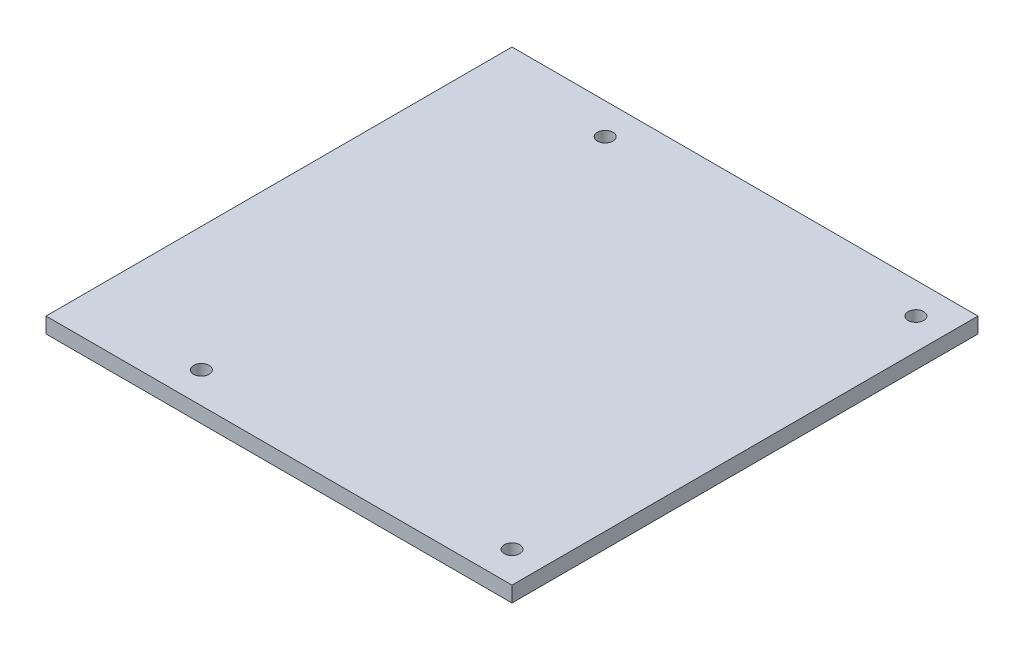
ISO-10303-21;
HEADER;
FILE_DESCRIPTION(('STEP AP214'),'2;1');
FILE_NAME('part.step','',(''),(''),'','','');
FILE_SCHEMA(('AUTOMOTIVE_DESIGN { 1 0 10303 214 1 1 1 1 }'));
ENDSEC;
DATA;
#1=APPLICATION_CONTEXT('core data for automotive mechanical design processes');
#2=APPLICATION_PROTOCOL_DEFINITION('international standard','automotive_design',2000,#1);
#3=PRODUCT_CONTEXT('',#1,'mechanical');
#4=PRODUCT('Part','Part','',(#3));
#5=PRODUCT_RELATED_PRODUCT_CATEGORY('part','',(#4));
#6=PRODUCT_DEFINITION_FORMATION('','',#4);
#7=PRODUCT_DEFINITION_CONTEXT('part definition',#1,'design');
#8=PRODUCT_DEFINITION('design','',#6,#7);
#9=PRODUCT_DEFINITION_SHAPE('','',#8);
#10=(LENGTH_UNIT() NAMED_UNIT(*) SI_UNIT(.MILLI.,.METRE.));
#11=(NAMED_UNIT(*) PLANE_ANGLE_UNIT() SI_UNIT($,.RADIAN.));
#12=(NAMED_UNIT(*) SI_UNIT($,.STERADIAN.) SOLID_ANGLE_UNIT());
#13=UNCERTAINTY_MEASURE_WITH_UNIT(LENGTH_MEASURE(1.E-05),#10,'distance_accuracy_value','');
#14=(GEOMETRIC_REPRESENTATION_CONTEXT(3) GLOBAL_UNCERTAINTY_ASSIGNED_CONTEXT((#13)) GLOBAL_UNIT_ASSIGNED_CONTEXT((#10,
#11,#12)) REPRESENTATION_CONTEXT('',''));
#15=CARTESIAN_POINT('',(0.,0.,0.));
#16=DIRECTION('',(0.,0.,1.));
#17=DIRECTION('',(1.,0.,0.));
#18=AXIS2_PLACEMENT_3D('',#15,#16,#17);
#19=CARTESIAN_POINT('',(67.2311089141539,5.,0.));
#20=DIRECTION('',(1.,0.,0.));
#21=DIRECTION('',(0.,0.,-1.));
#22=AXIS2_PLACEMENT_3D('',#19,#20,#21);
#23=PLANE('',#22);
#24=DIRECTION('',(0.,0.,1.));
#25=VECTOR('',#24,1.);
#26=CARTESIAN_POINT('',(67.2311089141539,0.,0.));
#27=LINE('',#26,#25);
#28=CARTESIAN_POINT('',(67.2311089141539,0.,-32.5441423628275));
#29=VERTEX_POINT('',#28);
#30=CARTESIAN_POINT('',(67.2311089141539,0.,117.455857637172));
#31=VERTEX_POINT('',#30);
#32=EDGE_CURVE('E132',#29,#31,#27,.T.);
#33=ORIENTED_EDGE('',*,*,#32,.F.);
#34=DIRECTION('',(0.,-1.,0.));
#35=VECTOR('',#34,1.);
#36=CARTESIAN_POINT('',(67.2311089141539,5.,-32.5441423628275));
#37=LINE('',#36,#35);
#38=CARTESIAN_POINT('',(67.2311089141539,5.,-32.5441423628275));
#39=VERTEX_POINT('',#38);
#40=EDGE_CURVE('E11',#39,#29,#37,.T.);
#41=ORIENTED_EDGE('',*,*,#40,.F.);
#42=DIRECTION('',(0.,0.,1.));
#43=VECTOR('',#42,1.);
#44=CARTESIAN_POINT('',(67.2311089141539,5.,0.));
#45=LINE('',#44,#43);
#46=CARTESIAN_POINT('',(67.2311089141539,5.,117.455857637172));
#47=VERTEX_POINT('',#46);
#48=EDGE_CURVE('E106',#39,#47,#45,.T.);
#49=ORIENTED_EDGE('',*,*,#48,.T.);
#50=DIRECTION('',(0.,-1.,0.));
#51=VECTOR('',#50,1.);
#52=CARTESIAN_POINT('',(67.2311089141539,5.,117.455857637172));
#53=LINE('',#52,#51);
#54=EDGE_CURVE('E82',#47,#31,#53,.T.);
#55=ORIENTED_EDGE('',*,*,#54,.T.);
#56=EDGE_LOOP('',(#33,#41,#49,#55));
#57=FACE_BOUND('',#56,.T.);
#58=ADVANCED_FACE('F41',(#57),#23,.T.);
#59=CARTESIAN_POINT('',(0.,5.,-32.5441423628275));
#60=DIRECTION('',(0.,0.,-1.));
#61=DIRECTION('',(-1.,0.,0.));
#62=AXIS2_PLACEMENT_3D('',#59,#60,#61);
#63=PLANE('',#62);
#64=DIRECTION('',(1.,0.,0.));
#65=VECTOR('',#64,1.);
#66=CARTESIAN_POINT('',(0.,0.,-32.5441423628275));
#67=LINE('',#66,#65);
#68=CARTESIAN_POINT('',(-82.7688910858461,0.,-32.5441423628275));
#69=VERTEX_POINT('',#68);
#70=EDGE_CURVE('E94',#69,#29,#67,.T.);
#71=ORIENTED_EDGE('',*,*,#70,.F.);
#72=DIRECTION('',(0.,-1.,0.));
#73=VECTOR('',#72,1.);
#74=CARTESIAN_POINT('',(-82.7688910858461,5.,-32.5441423628275));
#75=LINE('',#74,#73);
#76=CARTESIAN_POINT('',(-82.7688910858461,5.,-32.5441423628275));
#77=VERTEX_POINT('',#76);
#78=EDGE_CURVE('E51',#77,#69,#75,.T.);
#79=ORIENTED_EDGE('',*,*,#78,.F.);
#80=DIRECTION('',(1.,0.,0.));
#81=VECTOR('',#80,1.);
#82=CARTESIAN_POINT('',(0.,5.,-32.5441423628275));
#83=LINE('',#82,#81);
#84=EDGE_CURVE('E92',#77,#39,#83,.T.);
#85=ORIENTED_EDGE('',*,*,#84,.T.);
#86=ORIENTED_EDGE('',*,*,#40,.T.);
#87=EDGE_LOOP('',(#71,#79,#85,#86));
#88=FACE_BOUND('',#87,.T.);
#89=ADVANCED_FACE('F90',(#88),#63,.T.);
#90=CARTESIAN_POINT('',(-82.7688910858461,5.,0.));
#91=DIRECTION('',(1.,0.,0.));
#92=DIRECTION('',(0.,0.,-1.));
#93=AXIS2_PLACEMENT_3D('',#90,#91,#92);
#94=PLANE('',#93);
#95=DIRECTION('',(0.,0.,1.));
#96=VECTOR('',#95,1.);
#97=CARTESIAN_POINT('',(-82.7688910858461,0.,0.));
#98=LINE('',#97,#96);
#99=CARTESIAN_POINT('',(-82.7688910858461,0.,117.455857637172));
#100=VERTEX_POINT('',#99);
#101=EDGE_CURVE('E137',#69,#100,#98,.T.);
#102=ORIENTED_EDGE('',*,*,#101,.T.);
#103=DIRECTION('',(0.,-1.,0.));
#104=VECTOR('',#103,1.);
#105=CARTESIAN_POINT('',(-82.7688910858461,5.,117.455857637172));
#106=LINE('',#105,#104);
#107=CARTESIAN_POINT('',(-82.7688910858461,5.,117.455857637172));
#108=VERTEX_POINT('',#107);
#109=EDGE_CURVE('E98',#108,#100,#106,.T.);
#110=ORIENTED_EDGE('',*,*,#109,.F.);
#111=DIRECTION('',(0.,0.,1.));
#112=VECTOR('',#111,1.);
#113=CARTESIAN_POINT('',(-82.7688910858461,5.,0.));
#114=LINE('',#113,#112);
#115=EDGE_CURVE('E100',#77,#108,#114,.T.);
#116=ORIENTED_EDGE('',*,*,#115,.F.);
#117=ORIENTED_EDGE('',*,*,#78,.T.);
#118=EDGE_LOOP('',(#102,#110,#116,#117));
#119=FACE_BOUND('',#118,.T.);
#120=ADVANCED_FACE('F101',(#119),#94,.F.);
#121=CARTESIAN_POINT('',(57.2311089141539,5.,-22.5441423628275));
#122=DIRECTION('',(0.,-1.,0.));
#123=DIRECTION('',(0.,0.,-1.));
#124=AXIS2_PLACEMENT_3D('',#121,#122,#123);
#125=CYLINDRICAL_SURFACE('',#124,2.5);
#126=CARTESIAN_POINT('',(57.2311089141539,5.,-22.5441423628275));
#127=DIRECTION('',(0.,1.,0.));
#128=DIRECTION('',(0.,0.,1.));
#129=AXIS2_PLACEMENT_3D('',#126,#127,#128);
#130=CIRCLE('',#129,2.5);
#131=CARTESIAN_POINT('',(57.2311089141539,5.,-20.0441423628275));
#132=VERTEX_POINT('',#131);
#133=EDGE_CURVE('E120',#132,#132,#130,.T.);
#134=ORIENTED_EDGE('',*,*,#133,.T.);
#135=EDGE_LOOP('',(#134));
#136=FACE_BOUND('',#135,.T.);
#137=CARTESIAN_POINT('',(57.2311089141539,0.,-22.5441423628275));
#138=DIRECTION('',(0.,1.,0.));
#139=DIRECTION('',(0.,0.,1.));
#140=AXIS2_PLACEMENT_3D('',#137,#138,#139);
#141=CIRCLE('',#140,2.5);
#142=CARTESIAN_POINT('',(57.2311089141539,0.,-20.0441423628275));
#143=VERTEX_POINT('',#142);
#144=EDGE_CURVE('E146',#143,#143,#141,.T.);
#145=ORIENTED_EDGE('',*,*,#144,.F.);
#146=EDGE_LOOP('',(#145));
#147=FACE_BOUND('',#146,.T.);
#148=ADVANCED_FACE('F169',(#136,#147),#125,.F.);
#149=CARTESIAN_POINT('',(-42.7688910858461,5.,107.455857637173));
#150=DIRECTION('',(0.,-1.,0.));
#151=DIRECTION('',(0.,0.,-1.));
#152=AXIS2_PLACEMENT_3D('',#149,#150,#151);
#153=CYLINDRICAL_SURFACE('',#152,2.49999999999999);
#154=CARTESIAN_POINT('',(-42.7688910858461,5.,107.455857637173));
#155=DIRECTION('',(0.,1.,0.));
#156=DIRECTION('',(0.,0.,1.));
#157=AXIS2_PLACEMENT_3D('',#154,#155,#156);
#158=CIRCLE('',#157,2.49999999999999);
#159=CARTESIAN_POINT('',(-42.7688910858461,5.,109.955857637173));
#160=VERTEX_POINT('',#159);
#161=EDGE_CURVE('E116',#160,#160,#158,.F.);
#162=ORIENTED_EDGE('',*,*,#161,.F.);
#163=EDGE_LOOP('',(#162));
#164=FACE_BOUND('',#163,.T.);
#165=CARTESIAN_POINT('',(-42.7688910858461,0.,107.455857637173));
#166=DIRECTION('',(0.,1.,0.));
#167=DIRECTION('',(0.,0.,1.));
#168=AXIS2_PLACEMENT_3D('',#165,#166,#167);
#169=CIRCLE('',#168,2.49999999999999);
#170=CARTESIAN_POINT('',(-42.7688910858461,0.,109.955857637173));
#171=VERTEX_POINT('',#170);
#172=EDGE_CURVE('E142',#171,#171,#169,.F.);
#173=ORIENTED_EDGE('',*,*,#172,.T.);
#174=EDGE_LOOP('',(#173));
#175=FACE_BOUND('',#174,.T.);
#176=ADVANCED_FACE('F172',(#164,#175),#153,.F.);
#177=CARTESIAN_POINT('',(0.,5.,117.455857637172));
#178=DIRECTION('',(0.,0.,-1.));
#179=DIRECTION('',(-1.,0.,0.));
#180=AXIS2_PLACEMENT_3D('',#177,#178,#179);
#181=PLANE('',#180);
#182=DIRECTION('',(1.,0.,0.));
#183=VECTOR('',#182,1.);
#184=CARTESIAN_POINT('',(0.,0.,117.455857637172));
#185=LINE('',#184,#183);
#186=EDGE_CURVE('E75',#100,#31,#185,.T.);
#187=ORIENTED_EDGE('',*,*,#186,.T.);
#188=ORIENTED_EDGE('',*,*,#54,.F.);
#189=DIRECTION('',(1.,0.,0.));
#190=VECTOR('',#189,1.);
#191=CARTESIAN_POINT('',(0.,5.,117.455857637172));
#192=LINE('',#191,#190);
#193=EDGE_CURVE('E59',#108,#47,#192,.T.);
#194=ORIENTED_EDGE('',*,*,#193,.F.);
#195=ORIENTED_EDGE('',*,*,#109,.T.);
#196=EDGE_LOOP('',(#187,#188,#194,#195));
#197=FACE_BOUND('',#196,.T.);
#198=ADVANCED_FACE('F158',(#197),#181,.F.);
#199=CARTESIAN_POINT('',(57.2311089141539,5.,107.455857637173));
#200=DIRECTION('',(0.,-1.,0.));
#201=DIRECTION('',(0.,0.,-1.));
#202=AXIS2_PLACEMENT_3D('',#199,#200,#201);
#203=CYLINDRICAL_SURFACE('',#202,2.5);
#204=CARTESIAN_POINT('',(57.2311089141539,5.,107.455857637173));
#205=DIRECTION('',(0.,1.,0.));
#206=DIRECTION('',(0.,0.,1.));
#207=AXIS2_PLACEMENT_3D('',#204,#205,#206);
#208=CIRCLE('',#207,2.5);
#209=CARTESIAN_POINT('',(57.2311089141539,5.,109.955857637173));
#210=VERTEX_POINT('',#209);
#211=EDGE_CURVE('E110',#210,#210,#208,.F.);
#212=ORIENTED_EDGE('',*,*,#211,.F.);
#213=EDGE_LOOP('',(#212));
#214=FACE_BOUND('',#213,.T.);
#215=CARTESIAN_POINT('',(57.2311089141539,0.,107.455857637173));
#216=DIRECTION('',(0.,1.,0.));
#217=DIRECTION('',(0.,0.,1.));
#218=AXIS2_PLACEMENT_3D('',#215,#216,#217);
#219=CIRCLE('',#218,2.5);
#220=CARTESIAN_POINT('',(57.2311089141539,0.,109.955857637173));
#221=VERTEX_POINT('',#220);
#222=EDGE_CURVE('E128',#221,#221,#219,.F.);
#223=ORIENTED_EDGE('',*,*,#222,.T.);
#224=EDGE_LOOP('',(#223));
#225=FACE_BOUND('',#224,.T.);
#226=ADVANCED_FACE('F43',(#214,#225),#203,.F.);
#227=CARTESIAN_POINT('',(-42.7688910858461,5.,-22.5441423628275));
#228=DIRECTION('',(0.,-1.,0.));
#229=DIRECTION('',(0.,0.,-1.));
#230=AXIS2_PLACEMENT_3D('',#227,#228,#229);
#231=CYLINDRICAL_SURFACE('',#230,2.49999999999999);
#232=CARTESIAN_POINT('',(-42.7688910858461,5.,-22.5441423628275));
#233=DIRECTION('',(0.,1.,0.));
#234=DIRECTION('',(0.,0.,1.));
#235=AXIS2_PLACEMENT_3D('',#232,#233,#234);
#236=CIRCLE('',#235,2.49999999999999);
#237=CARTESIAN_POINT('',(-42.7688910858461,5.,-20.0441423628275));
#238=VERTEX_POINT('',#237);
#239=EDGE_CURVE('E124',#238,#238,#236,.T.);
#240=ORIENTED_EDGE('',*,*,#239,.T.);
#241=EDGE_LOOP('',(#240));
#242=FACE_BOUND('',#241,.T.);
#243=CARTESIAN_POINT('',(-42.7688910858461,0.,-22.5441423628275));
#244=DIRECTION('',(0.,1.,0.));
#245=DIRECTION('',(0.,0.,1.));
#246=AXIS2_PLACEMENT_3D('',#243,#244,#245);
#247=CIRCLE('',#246,2.49999999999999);
#248=CARTESIAN_POINT('',(-42.7688910858461,0.,-20.0441423628275));
#249=VERTEX_POINT('',#248);
#250=EDGE_CURVE('E150',#249,#249,#247,.T.);
#251=ORIENTED_EDGE('',*,*,#250,.F.);
#252=EDGE_LOOP('',(#251));
#253=FACE_BOUND('',#252,.T.);
#254=ADVANCED_FACE('F179',(#242,#253),#231,.F.);
#255=CARTESIAN_POINT('',(0.,5.,0.));
#256=DIRECTION('',(0.,1.,0.));
#257=DIRECTION('',(0.,0.,1.));
#258=AXIS2_PLACEMENT_3D('',#255,#256,#257);
#259=PLANE('',#258);
#260=ORIENTED_EDGE('',*,*,#211,.T.);
#261=EDGE_LOOP('',(#260));
#262=FACE_BOUND('',#261,.T.);
#263=ORIENTED_EDGE('',*,*,#48,.F.);
#264=ORIENTED_EDGE('',*,*,#84,.F.);
#265=ORIENTED_EDGE('',*,*,#115,.T.);
#266=ORIENTED_EDGE('',*,*,#193,.T.);
#267=EDGE_LOOP('',(#263,#264,#265,#266));
#268=FACE_BOUND('',#267,.T.);
#269=ORIENTED_EDGE('',*,*,#161,.T.);
#270=EDGE_LOOP('',(#269));
#271=FACE_BOUND('',#270,.T.);
#272=ORIENTED_EDGE('',*,*,#133,.F.);
#273=EDGE_LOOP('',(#272));
#274=FACE_BOUND('',#273,.T.);
#275=ORIENTED_EDGE('',*,*,#239,.F.);
#276=EDGE_LOOP('',(#275));
#277=FACE_BOUND('',#276,.T.);
#278=ADVANCED_FACE('F104',(#262,#268,#271,#274,#277),#259,.T.);
#279=CARTESIAN_POINT('',(0.,0.,0.));
#280=DIRECTION('',(0.,1.,0.));
#281=DIRECTION('',(0.,0.,1.));
#282=AXIS2_PLACEMENT_3D('',#279,#280,#281);
#283=PLANE('',#282);
#284=ORIENTED_EDGE('',*,*,#222,.F.);
#285=EDGE_LOOP('',(#284));
#286=FACE_BOUND('',#285,.T.);
#287=ORIENTED_EDGE('',*,*,#32,.T.);
#288=ORIENTED_EDGE('',*,*,#186,.F.);
#289=ORIENTED_EDGE('',*,*,#101,.F.);
#290=ORIENTED_EDGE('',*,*,#70,.T.);
#291=EDGE_LOOP('',(#287,#288,#289,#290));
#292=FACE_BOUND('',#291,.T.);
#293=ORIENTED_EDGE('',*,*,#172,.F.);
#294=EDGE_LOOP('',(#293));
#295=FACE_BOUND('',#294,.T.);
#296=ORIENTED_EDGE('',*,*,#144,.T.);
#297=EDGE_LOOP('',(#296));
#298=FACE_BOUND('',#297,.T.);
#299=ORIENTED_EDGE('',*,*,#250,.T.);
#300=EDGE_LOOP('',(#299));
#301=FACE_BOUND('',#300,.T.);
#302=ADVANCED_FACE('F159',(#286,#292,#295,#298,#301),#283,.F.);
#303=CLOSED_SHELL('',(#58,#89,#120,#148,#176,#198,#226,#254,#278,#302));
#304=MANIFOLD_SOLID_BREP('B2',#303);
#305=ADVANCED_BREP_SHAPE_REPRESENTATION('',(#18,#304),#14);
#306=SHAPE_DEFINITION_REPRESENTATION(#9,#305);
ENDSEC;
END-ISO-10303-21;
